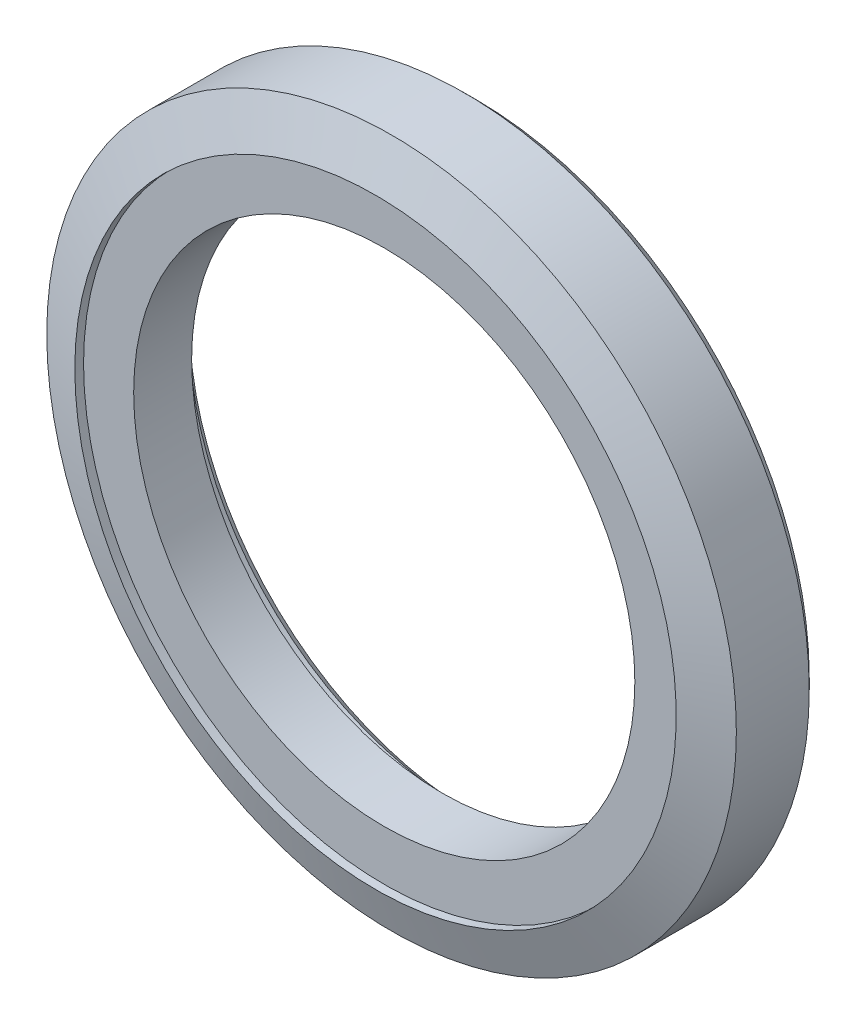
ISO-10303-21;
HEADER;
FILE_DESCRIPTION(('STEP AP214'),'2;1');
FILE_NAME('part.step','',(''),(''),'','','');
FILE_SCHEMA(('AUTOMOTIVE_DESIGN { 1 0 10303 214 1 1 1 1 }'));
ENDSEC;
DATA;
#1=APPLICATION_CONTEXT('core data for automotive mechanical design processes');
#2=APPLICATION_PROTOCOL_DEFINITION('international standard','automotive_design',2000,#1);
#3=PRODUCT_CONTEXT('',#1,'mechanical');
#4=PRODUCT('Part','Part','',(#3));
#5=PRODUCT_RELATED_PRODUCT_CATEGORY('part','',(#4));
#6=PRODUCT_DEFINITION_FORMATION('','',#4);
#7=PRODUCT_DEFINITION_CONTEXT('part definition',#1,'design');
#8=PRODUCT_DEFINITION('design','',#6,#7);
#9=PRODUCT_DEFINITION_SHAPE('','',#8);
#10=(LENGTH_UNIT() NAMED_UNIT(*) SI_UNIT(.MILLI.,.METRE.));
#11=(NAMED_UNIT(*) PLANE_ANGLE_UNIT() SI_UNIT($,.RADIAN.));
#12=(NAMED_UNIT(*) SI_UNIT($,.STERADIAN.) SOLID_ANGLE_UNIT());
#13=UNCERTAINTY_MEASURE_WITH_UNIT(LENGTH_MEASURE(1.E-05),#10,'distance_accuracy_value','');
#14=(GEOMETRIC_REPRESENTATION_CONTEXT(3) GLOBAL_UNCERTAINTY_ASSIGNED_CONTEXT((#13)) GLOBAL_UNIT_ASSIGNED_CONTEXT((#10,
#11,#12)) REPRESENTATION_CONTEXT('',''));
#15=CARTESIAN_POINT('',(0.,0.,0.));
#16=DIRECTION('',(0.,0.,1.));
#17=DIRECTION('',(1.,0.,0.));
#18=AXIS2_PLACEMENT_3D('',#15,#16,#17);
#19=CARTESIAN_POINT('',(0.,0.,6.35));
#20=DIRECTION('',(0.,0.,-1.));
#21=DIRECTION('',(-1.,0.,0.));
#22=AXIS2_PLACEMENT_3D('',#19,#20,#21);
#23=PLANE('',#22);
#24=CARTESIAN_POINT('',(0.,0.,6.35));
#25=DIRECTION('',(0.,0.,-1.));
#26=DIRECTION('',(-1.,0.,0.));
#27=AXIS2_PLACEMENT_3D('',#24,#25,#26);
#28=CIRCLE('',#27,20.955);
#29=CARTESIAN_POINT('',(-20.955,0.,6.35));
#30=VERTEX_POINT('',#29);
#31=EDGE_CURVE('E38',#30,#30,#28,.F.);
#32=ORIENTED_EDGE('',*,*,#31,.T.);
#33=EDGE_LOOP('',(#32));
#34=FACE_BOUND('',#33,.T.);
#35=CARTESIAN_POINT('',(0.,0.,6.35));
#36=DIRECTION('',(0.,0.,-1.));
#37=DIRECTION('',(-1.,0.,0.));
#38=AXIS2_PLACEMENT_3D('',#35,#36,#37);
#39=CIRCLE('',#38,17.4625);
#40=CARTESIAN_POINT('',(-17.4625,0.,6.35));
#41=VERTEX_POINT('',#40);
#42=EDGE_CURVE('E17',#41,#41,#39,.T.);
#43=ORIENTED_EDGE('',*,*,#42,.T.);
#44=EDGE_LOOP('',(#43));
#45=FACE_BOUND('',#44,.T.);
#46=ADVANCED_FACE('F14',(#34,#45),#23,.F.);
#47=CARTESIAN_POINT('',(0.,0.,6.35));
#48=DIRECTION('',(0.,0.,-1.));
#49=DIRECTION('',(-1.,0.,0.));
#50=AXIS2_PLACEMENT_3D('',#47,#48,#49);
#51=CYLINDRICAL_SURFACE('',#50,17.4625);
#52=ORIENTED_EDGE('',*,*,#42,.F.);
#53=EDGE_LOOP('',(#52));
#54=FACE_BOUND('',#53,.T.);
#55=CARTESIAN_POINT('',(0.,0.,2.3114));
#56=DIRECTION('',(0.,0.,-1.));
#57=DIRECTION('',(-1.,0.,0.));
#58=AXIS2_PLACEMENT_3D('',#55,#56,#57);
#59=CIRCLE('',#58,17.4625);
#60=CARTESIAN_POINT('',(-17.4625,0.,2.3114));
#61=VERTEX_POINT('',#60);
#62=EDGE_CURVE('E36',#61,#61,#59,.T.);
#63=ORIENTED_EDGE('',*,*,#62,.T.);
#64=EDGE_LOOP('',(#63));
#65=FACE_BOUND('',#64,.T.);
#66=ADVANCED_FACE('F46',(#54,#65),#51,.F.);
#67=CARTESIAN_POINT('',(0.,0.,7.30758));
#68=DIRECTION('',(0.,0.,-1.));
#69=DIRECTION('',(-1.,0.,0.));
#70=AXIS2_PLACEMENT_3D('',#67,#68,#69);
#71=CYLINDRICAL_SURFACE('',#70,20.955);
#72=CARTESIAN_POINT('',(0.,0.,6.95960000000047));
#73=DIRECTION('',(0.,0.,-1.));
#74=DIRECTION('',(-1.,0.,0.));
#75=AXIS2_PLACEMENT_3D('',#72,#73,#74);
#76=CIRCLE('',#75,20.9550000000002);
#77=CARTESIAN_POINT('',(-20.9550000000002,0.,6.95960000000047));
#78=VERTEX_POINT('',#77);
#79=EDGE_CURVE('E29',#78,#78,#76,.T.);
#80=ORIENTED_EDGE('',*,*,#79,.F.);
#81=EDGE_LOOP('',(#80));
#82=FACE_BOUND('',#81,.T.);
#83=ORIENTED_EDGE('',*,*,#31,.F.);
#84=EDGE_LOOP('',(#83));
#85=FACE_BOUND('',#84,.T.);
#86=ADVANCED_FACE('F49',(#82,#85),#71,.F.);
#87=CARTESIAN_POINT('',(0.,0.,2.3114));
#88=DIRECTION('',(0.,0.,1.));
#89=DIRECTION('',(1.,0.,0.));
#90=AXIS2_PLACEMENT_3D('',#87,#88,#89);
#91=PLANE('',#90);
#92=CARTESIAN_POINT('',(0.,0.,2.3114));
#93=DIRECTION('',(0.,0.,1.));
#94=DIRECTION('',(1.,0.,0.));
#95=AXIS2_PLACEMENT_3D('',#92,#93,#94);
#96=CIRCLE('',#95,19.177);
#97=CARTESIAN_POINT('',(19.177,0.,2.3114));
#98=VERTEX_POINT('',#97);
#99=EDGE_CURVE('E32',#98,#98,#96,.F.);
#100=ORIENTED_EDGE('',*,*,#99,.T.);
#101=EDGE_LOOP('',(#100));
#102=FACE_BOUND('',#101,.T.);
#103=ORIENTED_EDGE('',*,*,#62,.F.);
#104=EDGE_LOOP('',(#103));
#105=FACE_BOUND('',#104,.T.);
#106=ADVANCED_FACE('F52',(#102,#105),#91,.F.);
#107=CARTESIAN_POINT('',(0.,0.,5.84097388200652));
#108=DIRECTION('',(0.,0.,-1.));
#109=DIRECTION('',(-1.,0.,0.));
#110=AXIS2_PLACEMENT_3D('',#107,#108,#109);
#111=CONICAL_SURFACE('',#110,24.0283999999985,1.2217304763958);
#112=CARTESIAN_POINT('',(0.,0.,5.84097388200652));
#113=DIRECTION('',(0.,0.,-1.));
#114=DIRECTION('',(-1.,0.,0.));
#115=AXIS2_PLACEMENT_3D('',#112,#113,#114);
#116=CIRCLE('',#115,24.0284);
#117=CARTESIAN_POINT('',(-24.0284,0.,5.84097388200652));
#118=VERTEX_POINT('',#117);
#119=EDGE_CURVE('E35',#118,#118,#116,.T.);
#120=ORIENTED_EDGE('',*,*,#119,.F.);
#121=EDGE_LOOP('',(#120));
#122=FACE_BOUND('',#121,.T.);
#123=ORIENTED_EDGE('',*,*,#79,.T.);
#124=EDGE_LOOP('',(#123));
#125=FACE_BOUND('',#124,.T.);
#126=ADVANCED_FACE('F54',(#122,#125),#111,.T.);
#127=CARTESIAN_POINT('',(0.,0.,0.));
#128=DIRECTION('',(0.,0.,1.));
#129=DIRECTION('',(1.,0.,0.));
#130=AXIS2_PLACEMENT_3D('',#127,#128,#129);
#131=CYLINDRICAL_SURFACE('',#130,19.177);
#132=CARTESIAN_POINT('',(0.,0.,0.762000000000054));
#133=DIRECTION('',(0.,0.,-1.));
#134=DIRECTION('',(-1.,0.,0.));
#135=AXIS2_PLACEMENT_3D('',#132,#133,#134);
#136=CIRCLE('',#135,19.1770000000001);
#137=CARTESIAN_POINT('',(-19.1770000000001,0.,0.762000000000053));
#138=VERTEX_POINT('',#137);
#139=EDGE_CURVE('E93',#138,#138,#136,.T.);
#140=ORIENTED_EDGE('',*,*,#139,.T.);
#141=EDGE_LOOP('',(#140));
#142=FACE_BOUND('',#141,.T.);
#143=ORIENTED_EDGE('',*,*,#99,.F.);
#144=EDGE_LOOP('',(#143));
#145=FACE_BOUND('',#144,.T.);
#146=ADVANCED_FACE('F62',(#142,#145),#131,.F.);
#147=CARTESIAN_POINT('',(0.,0.,7.30758));
#148=DIRECTION('',(0.,0.,-1.));
#149=DIRECTION('',(-1.,0.,0.));
#150=AXIS2_PLACEMENT_3D('',#147,#148,#149);
#151=CYLINDRICAL_SURFACE('',#150,24.0284);
#152=CARTESIAN_POINT('',(0.,0.,0.762000000000054));
#153=DIRECTION('',(0.,0.,1.));
#154=DIRECTION('',(1.,0.,0.));
#155=AXIS2_PLACEMENT_3D('',#152,#153,#154);
#156=CIRCLE('',#155,24.0283999999999);
#157=CARTESIAN_POINT('',(24.0283999999999,0.,0.762000000000053));
#158=VERTEX_POINT('',#157);
#159=EDGE_CURVE('E26',#158,#158,#156,.F.);
#160=ORIENTED_EDGE('',*,*,#159,.F.);
#161=EDGE_LOOP('',(#160));
#162=FACE_BOUND('',#161,.T.);
#163=ORIENTED_EDGE('',*,*,#119,.T.);
#164=EDGE_LOOP('',(#163));
#165=FACE_BOUND('',#164,.T.);
#166=ADVANCED_FACE('F81',(#162,#165),#151,.T.);
#167=CARTESIAN_POINT('',(0.,0.,0.));
#168=DIRECTION('',(0.,0.,-1.));
#169=DIRECTION('',(-1.,0.,0.));
#170=AXIS2_PLACEMENT_3D('',#167,#168,#169);
#171=CONICAL_SURFACE('',#170,19.9389999999999,0.7853981633973);
#172=ORIENTED_EDGE('',*,*,#139,.F.);
#173=EDGE_LOOP('',(#172));
#174=FACE_BOUND('',#173,.T.);
#175=CARTESIAN_POINT('',(0.,0.,0.));
#176=DIRECTION('',(0.,0.,-1.));
#177=DIRECTION('',(-1.,0.,0.));
#178=AXIS2_PLACEMENT_3D('',#175,#176,#177);
#179=CIRCLE('',#178,19.9389999999999);
#180=CARTESIAN_POINT('',(-19.9389999999999,0.,0.));
#181=VERTEX_POINT('',#180);
#182=EDGE_CURVE('E21',#181,#181,#179,.F.);
#183=ORIENTED_EDGE('',*,*,#182,.F.);
#184=EDGE_LOOP('',(#183));
#185=FACE_BOUND('',#184,.T.);
#186=ADVANCED_FACE('F74',(#174,#185),#171,.F.);
#187=CARTESIAN_POINT('',(0.,0.,0.762000000000053));
#188=DIRECTION('',(0.,0.,1.));
#189=DIRECTION('',(0.,-1.,0.));
#190=AXIS2_PLACEMENT_3D('',#187,#188,#189);
#191=CONICAL_SURFACE('',#190,24.0283999999999,0.785398163397299);
#192=ORIENTED_EDGE('',*,*,#159,.T.);
#193=EDGE_LOOP('',(#192));
#194=FACE_BOUND('',#193,.T.);
#195=CARTESIAN_POINT('',(0.,0.,0.));
#196=DIRECTION('',(0.,0.,1.));
#197=DIRECTION('',(0.,-1.,0.));
#198=AXIS2_PLACEMENT_3D('',#195,#196,#197);
#199=CIRCLE('',#198,23.2664000000001);
#200=CARTESIAN_POINT('',(0.,-23.2664000000001,0.));
#201=VERTEX_POINT('',#200);
#202=EDGE_CURVE('E9',#201,#201,#199,.F.);
#203=ORIENTED_EDGE('',*,*,#202,.F.);
#204=EDGE_LOOP('',(#203));
#205=FACE_BOUND('',#204,.T.);
#206=ADVANCED_FACE('F69',(#194,#205),#191,.T.);
#207=CARTESIAN_POINT('',(0.,0.,0.));
#208=DIRECTION('',(0.,0.,-1.));
#209=DIRECTION('',(-1.,0.,0.));
#210=AXIS2_PLACEMENT_3D('',#207,#208,#209);
#211=PLANE('',#210);
#212=ORIENTED_EDGE('',*,*,#202,.T.);
#213=EDGE_LOOP('',(#212));
#214=FACE_BOUND('',#213,.T.);
#215=ORIENTED_EDGE('',*,*,#182,.T.);
#216=EDGE_LOOP('',(#215));
#217=FACE_BOUND('',#216,.T.);
#218=ADVANCED_FACE('F67',(#214,#217),#211,.T.);
#219=CLOSED_SHELL('',(#46,#66,#86,#106,#126,#146,#166,#186,#206,#218));
#220=MANIFOLD_SOLID_BREP('B1',#219);
#221=ADVANCED_BREP_SHAPE_REPRESENTATION('',(#18,#220),#14);
#222=SHAPE_DEFINITION_REPRESENTATION(#9,#221);
ENDSEC;
END-ISO-10303-21;
